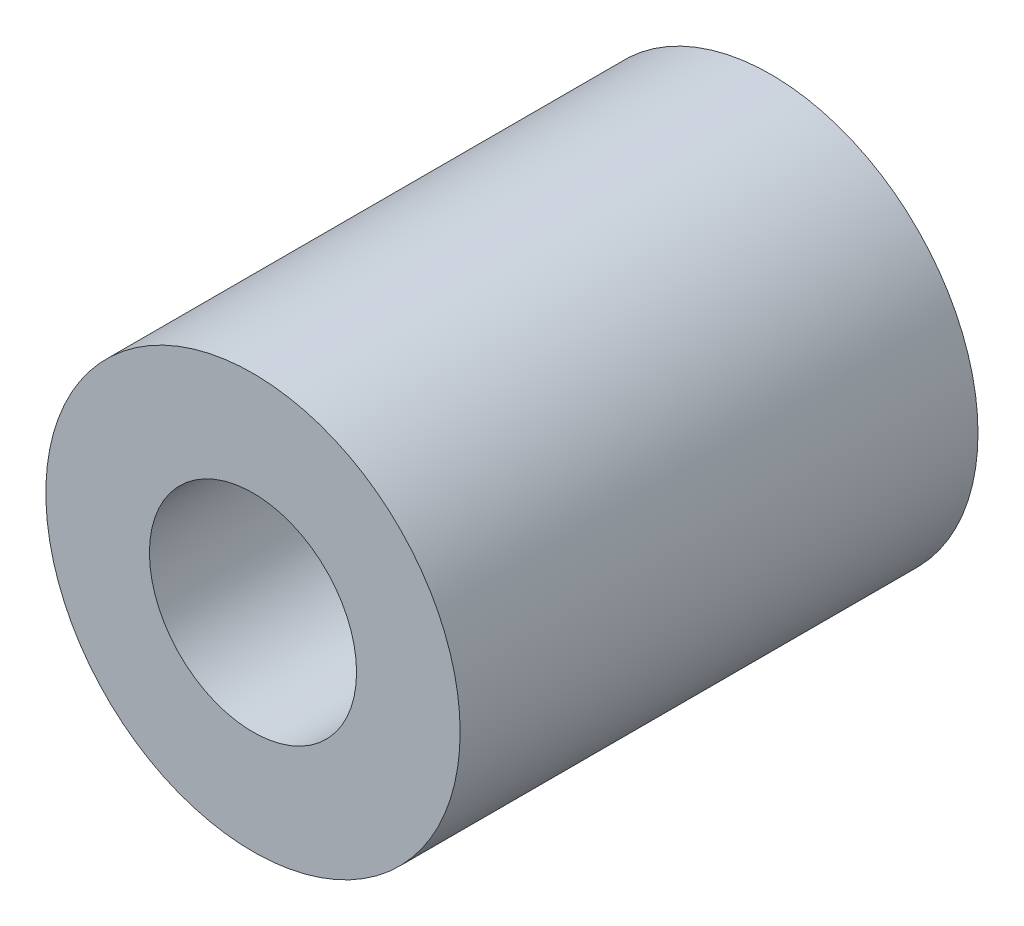
ISO-10303-21;
HEADER;
FILE_DESCRIPTION(('STEP AP214'),'2;1');
FILE_NAME('part.step','',(''),(''),'','','');
FILE_SCHEMA(('AUTOMOTIVE_DESIGN { 1 0 10303 214 1 1 1 1 }'));
ENDSEC;
DATA;
#1=APPLICATION_CONTEXT('core data for automotive mechanical design processes');
#2=APPLICATION_PROTOCOL_DEFINITION('international standard','automotive_design',2000,#1);
#3=PRODUCT_CONTEXT('',#1,'mechanical');
#4=PRODUCT('Part','Part','',(#3));
#5=PRODUCT_RELATED_PRODUCT_CATEGORY('part','',(#4));
#6=PRODUCT_DEFINITION_FORMATION('','',#4);
#7=PRODUCT_DEFINITION_CONTEXT('part definition',#1,'design');
#8=PRODUCT_DEFINITION('design','',#6,#7);
#9=PRODUCT_DEFINITION_SHAPE('','',#8);
#10=(LENGTH_UNIT() NAMED_UNIT(*) SI_UNIT(.MILLI.,.METRE.));
#11=(NAMED_UNIT(*) PLANE_ANGLE_UNIT() SI_UNIT($,.RADIAN.));
#12=(NAMED_UNIT(*) SI_UNIT($,.STERADIAN.) SOLID_ANGLE_UNIT());
#13=UNCERTAINTY_MEASURE_WITH_UNIT(LENGTH_MEASURE(1.E-05),#10,'distance_accuracy_value','');
#14=(GEOMETRIC_REPRESENTATION_CONTEXT(3) GLOBAL_UNCERTAINTY_ASSIGNED_CONTEXT((#13)) GLOBAL_UNIT_ASSIGNED_CONTEXT((#10,
#11,#12)) REPRESENTATION_CONTEXT('',''));
#15=CARTESIAN_POINT('',(0.,0.,0.));
#16=DIRECTION('',(0.,0.,1.));
#17=DIRECTION('',(1.,0.,0.));
#18=AXIS2_PLACEMENT_3D('',#15,#16,#17);
#19=CARTESIAN_POINT('',(0.,0.,15.));
#20=DIRECTION('',(0.,0.,1.));
#21=DIRECTION('',(1.,0.,0.));
#22=AXIS2_PLACEMENT_3D('',#19,#20,#21);
#23=PLANE('',#22);
#24=CARTESIAN_POINT('',(0.,0.,15.));
#25=DIRECTION('',(0.,0.,1.));
#26=DIRECTION('',(1.,0.,0.));
#27=AXIS2_PLACEMENT_3D('',#24,#25,#26);
#28=CIRCLE('',#27,6.);
#29=CARTESIAN_POINT('',(6.,0.,15.));
#30=VERTEX_POINT('',#29);
#31=EDGE_CURVE('E12',#30,#30,#28,.T.);
#32=ORIENTED_EDGE('',*,*,#31,.T.);
#33=EDGE_LOOP('',(#32));
#34=FACE_BOUND('',#33,.T.);
#35=CARTESIAN_POINT('',(0.,0.,15.));
#36=DIRECTION('',(0.,0.,1.));
#37=DIRECTION('',(1.,0.,0.));
#38=AXIS2_PLACEMENT_3D('',#35,#36,#37);
#39=CIRCLE('',#38,3.);
#40=CARTESIAN_POINT('',(3.,0.,15.));
#41=VERTEX_POINT('',#40);
#42=EDGE_CURVE('E55',#41,#41,#39,.T.);
#43=ORIENTED_EDGE('',*,*,#42,.F.);
#44=EDGE_LOOP('',(#43));
#45=FACE_BOUND('',#44,.T.);
#46=ADVANCED_FACE('F44',(#34,#45),#23,.T.);
#47=CARTESIAN_POINT('',(0.,0.,0.));
#48=DIRECTION('',(0.,0.,1.));
#49=DIRECTION('',(1.,0.,0.));
#50=AXIS2_PLACEMENT_3D('',#47,#48,#49);
#51=PLANE('',#50);
#52=CARTESIAN_POINT('',(0.,0.,0.));
#53=DIRECTION('',(0.,0.,1.));
#54=DIRECTION('',(1.,0.,0.));
#55=AXIS2_PLACEMENT_3D('',#52,#53,#54);
#56=CIRCLE('',#55,6.);
#57=CARTESIAN_POINT('',(6.,0.,0.));
#58=VERTEX_POINT('',#57);
#59=EDGE_CURVE('E48',#58,#58,#56,.T.);
#60=ORIENTED_EDGE('',*,*,#59,.F.);
#61=EDGE_LOOP('',(#60));
#62=FACE_BOUND('',#61,.T.);
#63=CARTESIAN_POINT('',(0.,0.,0.));
#64=DIRECTION('',(0.,0.,1.));
#65=DIRECTION('',(1.,0.,0.));
#66=AXIS2_PLACEMENT_3D('',#63,#64,#65);
#67=CIRCLE('',#66,3.);
#68=CARTESIAN_POINT('',(3.,0.,0.));
#69=VERTEX_POINT('',#68);
#70=EDGE_CURVE('E57',#69,#69,#67,.T.);
#71=ORIENTED_EDGE('',*,*,#70,.T.);
#72=EDGE_LOOP('',(#71));
#73=FACE_BOUND('',#72,.T.);
#74=ADVANCED_FACE('F67',(#62,#73),#51,.F.);
#75=CARTESIAN_POINT('',(0.,0.,15.));
#76=DIRECTION('',(0.,0.,-1.));
#77=DIRECTION('',(-1.,0.,0.));
#78=AXIS2_PLACEMENT_3D('',#75,#76,#77);
#79=CYLINDRICAL_SURFACE('',#78,6.);
#80=ORIENTED_EDGE('',*,*,#31,.F.);
#81=EDGE_LOOP('',(#80));
#82=FACE_BOUND('',#81,.T.);
#83=ORIENTED_EDGE('',*,*,#59,.T.);
#84=EDGE_LOOP('',(#83));
#85=FACE_BOUND('',#84,.T.);
#86=ADVANCED_FACE('F46',(#82,#85),#79,.T.);
#87=CARTESIAN_POINT('',(0.,0.,15.));
#88=DIRECTION('',(0.,0.,-1.));
#89=DIRECTION('',(-1.,0.,0.));
#90=AXIS2_PLACEMENT_3D('',#87,#88,#89);
#91=CYLINDRICAL_SURFACE('',#90,3.);
#92=ORIENTED_EDGE('',*,*,#42,.T.);
#93=EDGE_LOOP('',(#92));
#94=FACE_BOUND('',#93,.T.);
#95=ORIENTED_EDGE('',*,*,#70,.F.);
#96=EDGE_LOOP('',(#95));
#97=FACE_BOUND('',#96,.T.);
#98=ADVANCED_FACE('F63',(#94,#97),#91,.F.);
#99=CLOSED_SHELL('',(#46,#74,#86,#98));
#100=MANIFOLD_SOLID_BREP('B2',#99);
#101=ADVANCED_BREP_SHAPE_REPRESENTATION('',(#18,#100),#14);
#102=SHAPE_DEFINITION_REPRESENTATION(#9,#101);
ENDSEC;
END-ISO-10303-21;
